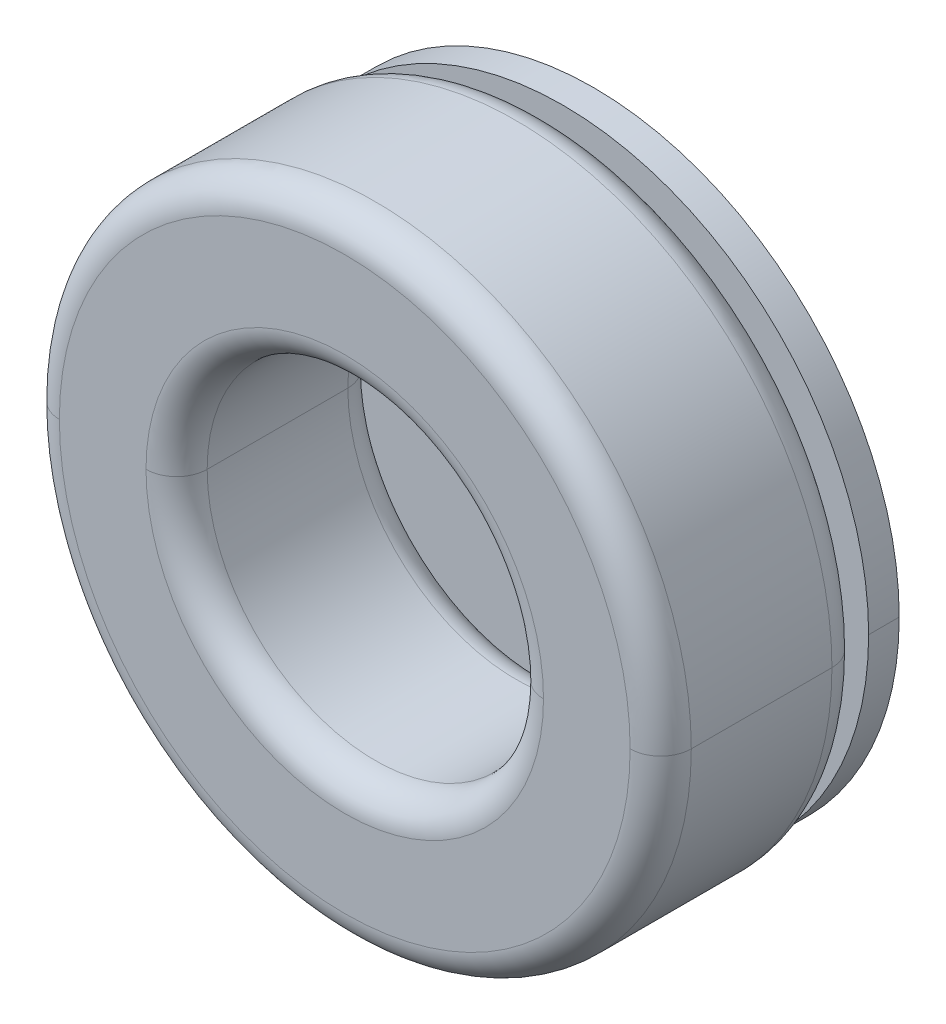
ISO-10303-21;
HEADER;
FILE_DESCRIPTION(('STEP AP214'),'2;1');
FILE_NAME('part.step','',(''),(''),'','','');
FILE_SCHEMA(('AUTOMOTIVE_DESIGN { 1 0 10303 214 1 1 1 1 }'));
ENDSEC;
DATA;
#1=APPLICATION_CONTEXT('core data for automotive mechanical design processes');
#2=APPLICATION_PROTOCOL_DEFINITION('international standard','automotive_design',2000,#1);
#3=PRODUCT_CONTEXT('',#1,'mechanical');
#4=PRODUCT('Part','Part','',(#3));
#5=PRODUCT_RELATED_PRODUCT_CATEGORY('part','',(#4));
#6=PRODUCT_DEFINITION_FORMATION('','',#4);
#7=PRODUCT_DEFINITION_CONTEXT('part definition',#1,'design');
#8=PRODUCT_DEFINITION('design','',#6,#7);
#9=PRODUCT_DEFINITION_SHAPE('','',#8);
#10=(LENGTH_UNIT() NAMED_UNIT(*) SI_UNIT(.MILLI.,.METRE.));
#11=(NAMED_UNIT(*) PLANE_ANGLE_UNIT() SI_UNIT($,.RADIAN.));
#12=(NAMED_UNIT(*) SI_UNIT($,.STERADIAN.) SOLID_ANGLE_UNIT());
#13=UNCERTAINTY_MEASURE_WITH_UNIT(LENGTH_MEASURE(1.E-05),#10,'distance_accuracy_value','');
#14=(GEOMETRIC_REPRESENTATION_CONTEXT(3) GLOBAL_UNCERTAINTY_ASSIGNED_CONTEXT((#13)) GLOBAL_UNIT_ASSIGNED_CONTEXT((#10,
#11,#12)) REPRESENTATION_CONTEXT('',''));
#15=CARTESIAN_POINT('',(0.,0.,0.));
#16=DIRECTION('',(0.,0.,1.));
#17=DIRECTION('',(1.,0.,0.));
#18=AXIS2_PLACEMENT_3D('',#15,#16,#17);
#19=CARTESIAN_POINT('',(0.,0.,2.3));
#20=DIRECTION('',(0.,0.,-1.));
#21=DIRECTION('',(0.,-1.,0.));
#22=AXIS2_PLACEMENT_3D('',#19,#20,#21);
#23=PLANE('',#22);
#24=CARTESIAN_POINT('',(0.,0.,2.3));
#25=DIRECTION('',(0.,0.,1.));
#26=DIRECTION('',(1.,0.,0.));
#27=AXIS2_PLACEMENT_3D('',#24,#25,#26);
#28=CIRCLE('',#27,9.75);
#29=CARTESIAN_POINT('',(9.75,0.,2.3));
#30=VERTEX_POINT('',#29);
#31=CARTESIAN_POINT('',(-9.75,0.,2.3));
#32=VERTEX_POINT('',#31);
#33=EDGE_CURVE('P0_E118',#30,#32,#28,.T.);
#34=ORIENTED_EDGE('',*,*,#33,.T.);
#35=CARTESIAN_POINT('',(0.,0.,2.3));
#36=DIRECTION('',(0.,0.,1.));
#37=DIRECTION('',(1.,0.,0.));
#38=AXIS2_PLACEMENT_3D('',#35,#36,#37);
#39=CIRCLE('',#38,9.75);
#40=EDGE_CURVE('P0_E90',#32,#30,#39,.T.);
#41=ORIENTED_EDGE('',*,*,#40,.T.);
#42=EDGE_LOOP('',(#34,#41));
#43=FACE_BOUND('',#42,.T.);
#44=CARTESIAN_POINT('',(0.,0.,2.3));
#45=DIRECTION('',(0.,0.,1.));
#46=DIRECTION('',(1.,0.,0.));
#47=AXIS2_PLACEMENT_3D('',#44,#45,#46);
#48=CIRCLE('',#47,14.);
#49=CARTESIAN_POINT('',(14.,0.,2.3));
#50=VERTEX_POINT('',#49);
#51=CARTESIAN_POINT('',(-14.,0.,2.3));
#52=VERTEX_POINT('',#51);
#53=EDGE_CURVE('P0_E173',#50,#52,#48,.T.);
#54=ORIENTED_EDGE('',*,*,#53,.F.);
#55=CARTESIAN_POINT('',(0.,0.,2.3));
#56=DIRECTION('',(0.,0.,1.));
#57=DIRECTION('',(1.,0.,0.));
#58=AXIS2_PLACEMENT_3D('',#55,#56,#57);
#59=CIRCLE('',#58,14.);
#60=EDGE_CURVE('P0_E28',#52,#50,#59,.T.);
#61=ORIENTED_EDGE('',*,*,#60,.F.);
#62=EDGE_LOOP('',(#54,#61));
#63=FACE_BOUND('',#62,.T.);
#64=ADVANCED_FACE('P0_F17',(#43,#63),#23,.T.);
#65=CARTESIAN_POINT('',(0.,0.,12.2));
#66=DIRECTION('',(0.,0.,1.));
#67=DIRECTION('',(1.,0.,0.));
#68=AXIS2_PLACEMENT_3D('',#65,#66,#67);
#69=CYLINDRICAL_SURFACE('',#68,8.25);
#70=DIRECTION('',(0.,0.,1.));
#71=VECTOR('',#70,1.);
#72=CARTESIAN_POINT('',(-8.25,0.,12.2));
#73=LINE('',#72,#71);
#74=CARTESIAN_POINT('',(-8.25,0.,3.8));
#75=VERTEX_POINT('',#74);
#76=CARTESIAN_POINT('',(-8.25,0.,10.7));
#77=VERTEX_POINT('',#76);
#78=EDGE_CURVE('P0_E132',#75,#77,#73,.T.);
#79=ORIENTED_EDGE('',*,*,#78,.F.);
#80=CARTESIAN_POINT('',(0.,0.,3.8));
#81=DIRECTION('',(0.,0.,1.));
#82=DIRECTION('',(1.,0.,0.));
#83=AXIS2_PLACEMENT_3D('',#80,#81,#82);
#84=CIRCLE('',#83,8.25);
#85=CARTESIAN_POINT('',(8.25,0.,3.8));
#86=VERTEX_POINT('',#85);
#87=EDGE_CURVE('P0_E119',#86,#75,#84,.T.);
#88=ORIENTED_EDGE('',*,*,#87,.F.);
#89=DIRECTION('',(0.,0.,1.));
#90=VECTOR('',#89,1.);
#91=CARTESIAN_POINT('',(8.25,0.,12.2));
#92=LINE('',#91,#90);
#93=CARTESIAN_POINT('',(8.25,0.,10.7));
#94=VERTEX_POINT('',#93);
#95=EDGE_CURVE('P0_E143',#86,#94,#92,.T.);
#96=ORIENTED_EDGE('',*,*,#95,.T.);
#97=CARTESIAN_POINT('',(0.,0.,10.7));
#98=DIRECTION('',(0.,0.,1.));
#99=DIRECTION('',(1.,0.,0.));
#100=AXIS2_PLACEMENT_3D('',#97,#98,#99);
#101=CIRCLE('',#100,8.25);
#102=EDGE_CURVE('P0_E135',#94,#77,#101,.T.);
#103=ORIENTED_EDGE('',*,*,#102,.T.);
#104=EDGE_LOOP('',(#79,#88,#96,#103));
#105=FACE_BOUND('',#104,.T.);
#106=ADVANCED_FACE('P0_F133',(#105),#69,.F.);
#107=CARTESIAN_POINT('',(0.,0.,12.2));
#108=DIRECTION('',(0.,0.,1.));
#109=DIRECTION('',(1.,0.,0.));
#110=AXIS2_PLACEMENT_3D('',#107,#108,#109);
#111=PLANE('',#110);
#112=CARTESIAN_POINT('',(0.,0.,12.2));
#113=DIRECTION('',(0.,0.,1.));
#114=DIRECTION('',(1.,0.,0.));
#115=AXIS2_PLACEMENT_3D('',#112,#113,#114);
#116=CIRCLE('',#115,9.75);
#117=CARTESIAN_POINT('',(9.75,0.,12.2));
#118=VERTEX_POINT('',#117);
#119=CARTESIAN_POINT('',(-9.75,0.,12.2));
#120=VERTEX_POINT('',#119);
#121=EDGE_CURVE('P0_E181',#118,#120,#116,.T.);
#122=ORIENTED_EDGE('',*,*,#121,.F.);
#123=CARTESIAN_POINT('',(0.,0.,12.2));
#124=DIRECTION('',(0.,0.,1.));
#125=DIRECTION('',(1.,0.,0.));
#126=AXIS2_PLACEMENT_3D('',#123,#124,#125);
#127=CIRCLE('',#126,9.75);
#128=EDGE_CURVE('P0_E21',#120,#118,#127,.T.);
#129=ORIENTED_EDGE('',*,*,#128,.F.);
#130=EDGE_LOOP('',(#122,#129));
#131=FACE_BOUND('',#130,.T.);
#132=CARTESIAN_POINT('',(0.,0.,12.2));
#133=DIRECTION('',(0.,0.,1.));
#134=DIRECTION('',(1.,0.,0.));
#135=AXIS2_PLACEMENT_3D('',#132,#133,#134);
#136=CIRCLE('',#135,14.);
#137=CARTESIAN_POINT('',(14.,0.,12.2));
#138=VERTEX_POINT('',#137);
#139=CARTESIAN_POINT('',(-14.,0.,12.2));
#140=VERTEX_POINT('',#139);
#141=EDGE_CURVE('P0_E159',#138,#140,#136,.T.);
#142=ORIENTED_EDGE('',*,*,#141,.T.);
#143=CARTESIAN_POINT('',(0.,0.,12.2));
#144=DIRECTION('',(0.,0.,1.));
#145=DIRECTION('',(1.,0.,0.));
#146=AXIS2_PLACEMENT_3D('',#143,#144,#145);
#147=CIRCLE('',#146,14.);
#148=EDGE_CURVE('P0_E80',#140,#138,#147,.T.);
#149=ORIENTED_EDGE('',*,*,#148,.T.);
#150=EDGE_LOOP('',(#142,#149));
#151=FACE_BOUND('',#150,.T.);
#152=ADVANCED_FACE('P0_F355',(#131,#151),#111,.T.);
#153=CARTESIAN_POINT('',(0.,0.,2.3));
#154=DIRECTION('',(0.,0.,1.));
#155=DIRECTION('',(1.,0.,0.));
#156=AXIS2_PLACEMENT_3D('',#153,#154,#155);
#157=CYLINDRICAL_SURFACE('',#156,15.5);
#158=DIRECTION('',(0.,0.,1.));
#159=VECTOR('',#158,1.);
#160=CARTESIAN_POINT('',(-15.5,0.,2.3));
#161=LINE('',#160,#159);
#162=CARTESIAN_POINT('',(-15.5,0.,3.8));
#163=VERTEX_POINT('',#162);
#164=CARTESIAN_POINT('',(-15.5,0.,10.7));
#165=VERTEX_POINT('',#164);
#166=EDGE_CURVE('P0_E166',#163,#165,#161,.T.);
#167=ORIENTED_EDGE('',*,*,#166,.F.);
#168=CARTESIAN_POINT('',(0.,0.,3.8));
#169=DIRECTION('',(0.,0.,1.));
#170=DIRECTION('',(1.,0.,0.));
#171=AXIS2_PLACEMENT_3D('',#168,#169,#170);
#172=CIRCLE('',#171,15.5);
#173=CARTESIAN_POINT('',(15.5,0.,3.8));
#174=VERTEX_POINT('',#173);
#175=EDGE_CURVE('P0_E11',#163,#174,#172,.T.);
#176=ORIENTED_EDGE('',*,*,#175,.T.);
#177=DIRECTION('',(0.,0.,1.));
#178=VECTOR('',#177,1.);
#179=CARTESIAN_POINT('',(15.5,0.,2.3));
#180=LINE('',#179,#178);
#181=CARTESIAN_POINT('',(15.5,0.,10.7));
#182=VERTEX_POINT('',#181);
#183=EDGE_CURVE('P0_E174',#174,#182,#180,.T.);
#184=ORIENTED_EDGE('',*,*,#183,.T.);
#185=CARTESIAN_POINT('',(0.,0.,10.7));
#186=DIRECTION('',(0.,0.,1.));
#187=DIRECTION('',(1.,0.,0.));
#188=AXIS2_PLACEMENT_3D('',#185,#186,#187);
#189=CIRCLE('',#188,15.5);
#190=EDGE_CURVE('P0_E152',#165,#182,#189,.T.);
#191=ORIENTED_EDGE('',*,*,#190,.F.);
#192=EDGE_LOOP('',(#167,#176,#184,#191));
#193=FACE_BOUND('',#192,.T.);
#194=ADVANCED_FACE('P0_F218',(#193),#157,.T.);
#195=CARTESIAN_POINT('',(0.,0.,3.8));
#196=DIRECTION('',(0.,0.,1.));
#197=DIRECTION('',(1.,0.,0.));
#198=AXIS2_PLACEMENT_3D('',#195,#196,#197);
#199=TOROIDAL_SURFACE('',#198,14.,1.5);
#200=CARTESIAN_POINT('',(-14.,0.,3.8));
#201=DIRECTION('',(0.,1.,0.));
#202=DIRECTION('',(-1.,0.,0.));
#203=AXIS2_PLACEMENT_3D('',#200,#201,#202);
#204=CIRCLE('',#203,1.5);
#205=EDGE_CURVE('P0_E168',#52,#163,#204,.T.);
#206=ORIENTED_EDGE('',*,*,#205,.F.);
#207=ORIENTED_EDGE('',*,*,#60,.T.);
#208=CARTESIAN_POINT('',(14.,0.,3.8));
#209=DIRECTION('',(0.,-1.,0.));
#210=DIRECTION('',(0.,0.,-1.));
#211=AXIS2_PLACEMENT_3D('',#208,#209,#210);
#212=CIRCLE('',#211,1.5);
#213=EDGE_CURVE('P0_E172',#50,#174,#212,.T.);
#214=ORIENTED_EDGE('',*,*,#213,.T.);
#215=ORIENTED_EDGE('',*,*,#175,.F.);
#216=EDGE_LOOP('',(#206,#207,#214,#215));
#217=FACE_BOUND('',#216,.T.);
#218=ADVANCED_FACE('P0_F207',(#217),#199,.T.);
#219=CARTESIAN_POINT('',(0.,0.,10.7));
#220=DIRECTION('',(0.,0.,1.));
#221=DIRECTION('',(1.,0.,0.));
#222=AXIS2_PLACEMENT_3D('',#219,#220,#221);
#223=TOROIDAL_SURFACE('',#222,14.,1.5);
#224=CARTESIAN_POINT('',(-14.,0.,10.7));
#225=DIRECTION('',(0.,1.,0.));
#226=DIRECTION('',(-1.,0.,0.));
#227=AXIS2_PLACEMENT_3D('',#224,#225,#226);
#228=CIRCLE('',#227,1.5);
#229=EDGE_CURVE('P0_E162',#165,#140,#228,.T.);
#230=ORIENTED_EDGE('',*,*,#229,.F.);
#231=ORIENTED_EDGE('',*,*,#190,.T.);
#232=CARTESIAN_POINT('',(14.,0.,10.7));
#233=DIRECTION('',(0.,-1.,0.));
#234=DIRECTION('',(0.,0.,-1.));
#235=AXIS2_PLACEMENT_3D('',#232,#233,#234);
#236=CIRCLE('',#235,1.5);
#237=EDGE_CURVE('P0_E129',#182,#138,#236,.T.);
#238=ORIENTED_EDGE('',*,*,#237,.T.);
#239=ORIENTED_EDGE('',*,*,#148,.F.);
#240=EDGE_LOOP('',(#230,#231,#238,#239));
#241=FACE_BOUND('',#240,.T.);
#242=ADVANCED_FACE('P0_F377',(#241),#223,.T.);
#243=CARTESIAN_POINT('',(0.,0.,3.8));
#244=DIRECTION('',(0.,0.,1.));
#245=DIRECTION('',(1.,0.,0.));
#246=AXIS2_PLACEMENT_3D('',#243,#244,#245);
#247=TOROIDAL_SURFACE('',#246,9.75,1.5);
#248=CARTESIAN_POINT('',(-9.75,0.,3.8));
#249=DIRECTION('',(0.,1.,0.));
#250=DIRECTION('',(-1.,0.,0.));
#251=AXIS2_PLACEMENT_3D('',#248,#249,#250);
#252=CIRCLE('',#251,1.5);
#253=EDGE_CURVE('P0_E110',#75,#32,#252,.T.);
#254=ORIENTED_EDGE('',*,*,#253,.F.);
#255=CARTESIAN_POINT('',(0.,0.,3.8));
#256=DIRECTION('',(0.,0.,1.));
#257=DIRECTION('',(1.,0.,0.));
#258=AXIS2_PLACEMENT_3D('',#255,#256,#257);
#259=CIRCLE('',#258,8.25);
#260=EDGE_CURVE('P0_E114',#75,#86,#259,.T.);
#261=ORIENTED_EDGE('',*,*,#260,.T.);
#262=CARTESIAN_POINT('',(9.75,0.,3.8));
#263=DIRECTION('',(0.,-1.,0.));
#264=DIRECTION('',(0.,0.,-1.));
#265=AXIS2_PLACEMENT_3D('',#262,#263,#264);
#266=CIRCLE('',#265,1.5);
#267=EDGE_CURVE('P0_E124',#86,#30,#266,.T.);
#268=ORIENTED_EDGE('',*,*,#267,.T.);
#269=ORIENTED_EDGE('',*,*,#40,.F.);
#270=EDGE_LOOP('',(#254,#261,#268,#269));
#271=FACE_BOUND('',#270,.T.);
#272=ADVANCED_FACE('P0_F112',(#271),#247,.T.);
#273=CARTESIAN_POINT('',(0.,0.,10.7));
#274=DIRECTION('',(0.,0.,1.));
#275=DIRECTION('',(1.,0.,0.));
#276=AXIS2_PLACEMENT_3D('',#273,#274,#275);
#277=TOROIDAL_SURFACE('',#276,9.75,1.5);
#278=CARTESIAN_POINT('',(-9.75,0.,10.7));
#279=DIRECTION('',(0.,1.,0.));
#280=DIRECTION('',(-1.,0.,0.));
#281=AXIS2_PLACEMENT_3D('',#278,#279,#280);
#282=CIRCLE('',#281,1.5);
#283=EDGE_CURVE('P0_E179',#120,#77,#282,.T.);
#284=ORIENTED_EDGE('',*,*,#283,.F.);
#285=ORIENTED_EDGE('',*,*,#128,.T.);
#286=CARTESIAN_POINT('',(9.75,0.,10.7));
#287=DIRECTION('',(0.,-1.,0.));
#288=DIRECTION('',(0.,0.,-1.));
#289=AXIS2_PLACEMENT_3D('',#286,#287,#288);
#290=CIRCLE('',#289,1.5);
#291=EDGE_CURVE('P0_E473',#118,#94,#290,.T.);
#292=ORIENTED_EDGE('',*,*,#291,.T.);
#293=CARTESIAN_POINT('',(0.,0.,10.7));
#294=DIRECTION('',(0.,0.,1.));
#295=DIRECTION('',(1.,0.,0.));
#296=AXIS2_PLACEMENT_3D('',#293,#294,#295);
#297=CIRCLE('',#296,8.25);
#298=EDGE_CURVE('P0_E140',#77,#94,#297,.T.);
#299=ORIENTED_EDGE('',*,*,#298,.F.);
#300=EDGE_LOOP('',(#284,#285,#292,#299));
#301=FACE_BOUND('',#300,.T.);
#302=ADVANCED_FACE('P0_F385',(#301),#277,.T.);
#303=CARTESIAN_POINT('',(0.,0.,10.7));
#304=DIRECTION('',(0.,0.,1.));
#305=DIRECTION('',(1.,0.,0.));
#306=AXIS2_PLACEMENT_3D('',#303,#304,#305);
#307=TOROIDAL_SURFACE('',#306,9.75,1.5);
#308=ORIENTED_EDGE('',*,*,#121,.T.);
#309=ORIENTED_EDGE('',*,*,#283,.T.);
#310=ORIENTED_EDGE('',*,*,#102,.F.);
#311=ORIENTED_EDGE('',*,*,#291,.F.);
#312=EDGE_LOOP('',(#308,#309,#310,#311));
#313=FACE_BOUND('',#312,.T.);
#314=ADVANCED_FACE('P0_F389',(#313),#307,.T.);
#315=CARTESIAN_POINT('',(0.,0.,3.8));
#316=DIRECTION('',(0.,0.,1.));
#317=DIRECTION('',(1.,0.,0.));
#318=AXIS2_PLACEMENT_3D('',#315,#316,#317);
#319=TOROIDAL_SURFACE('',#318,9.75,1.5);
#320=ORIENTED_EDGE('',*,*,#87,.T.);
#321=ORIENTED_EDGE('',*,*,#253,.T.);
#322=ORIENTED_EDGE('',*,*,#33,.F.);
#323=ORIENTED_EDGE('',*,*,#267,.F.);
#324=EDGE_LOOP('',(#320,#321,#322,#323));
#325=FACE_BOUND('',#324,.T.);
#326=ADVANCED_FACE('P0_F123',(#325),#319,.T.);
#327=CARTESIAN_POINT('',(0.,0.,10.7));
#328=DIRECTION('',(0.,0.,1.));
#329=DIRECTION('',(1.,0.,0.));
#330=AXIS2_PLACEMENT_3D('',#327,#328,#329);
#331=TOROIDAL_SURFACE('',#330,14.,1.5);
#332=CARTESIAN_POINT('',(0.,0.,10.7));
#333=DIRECTION('',(0.,0.,1.));
#334=DIRECTION('',(1.,0.,0.));
#335=AXIS2_PLACEMENT_3D('',#332,#333,#334);
#336=CIRCLE('',#335,15.5);
#337=EDGE_CURVE('P0_E178',#182,#165,#336,.T.);
#338=ORIENTED_EDGE('',*,*,#337,.T.);
#339=ORIENTED_EDGE('',*,*,#229,.T.);
#340=ORIENTED_EDGE('',*,*,#141,.F.);
#341=ORIENTED_EDGE('',*,*,#237,.F.);
#342=EDGE_LOOP('',(#338,#339,#340,#341));
#343=FACE_BOUND('',#342,.T.);
#344=ADVANCED_FACE('P0_F366',(#343),#331,.T.);
#345=CARTESIAN_POINT('',(0.,0.,3.8));
#346=DIRECTION('',(0.,0.,1.));
#347=DIRECTION('',(1.,0.,0.));
#348=AXIS2_PLACEMENT_3D('',#345,#346,#347);
#349=TOROIDAL_SURFACE('',#348,14.,1.5);
#350=ORIENTED_EDGE('',*,*,#53,.T.);
#351=ORIENTED_EDGE('',*,*,#205,.T.);
#352=CARTESIAN_POINT('',(0.,0.,3.8));
#353=DIRECTION('',(0.,0.,1.));
#354=DIRECTION('',(1.,0.,0.));
#355=AXIS2_PLACEMENT_3D('',#352,#353,#354);
#356=CIRCLE('',#355,15.5);
#357=EDGE_CURVE('P0_E163',#174,#163,#356,.T.);
#358=ORIENTED_EDGE('',*,*,#357,.F.);
#359=ORIENTED_EDGE('',*,*,#213,.F.);
#360=EDGE_LOOP('',(#350,#351,#358,#359));
#361=FACE_BOUND('',#360,.T.);
#362=ADVANCED_FACE('P0_F216',(#361),#349,.T.);
#363=CARTESIAN_POINT('',(0.,0.,2.3));
#364=DIRECTION('',(0.,0.,1.));
#365=DIRECTION('',(1.,0.,0.));
#366=AXIS2_PLACEMENT_3D('',#363,#364,#365);
#367=CYLINDRICAL_SURFACE('',#366,15.5);
#368=ORIENTED_EDGE('',*,*,#357,.T.);
#369=ORIENTED_EDGE('',*,*,#166,.T.);
#370=ORIENTED_EDGE('',*,*,#337,.F.);
#371=ORIENTED_EDGE('',*,*,#183,.F.);
#372=EDGE_LOOP('',(#368,#369,#370,#371));
#373=FACE_BOUND('',#372,.T.);
#374=ADVANCED_FACE('P0_F19',(#373),#367,.T.);
#375=CARTESIAN_POINT('',(0.,0.,12.2));
#376=DIRECTION('',(0.,0.,1.));
#377=DIRECTION('',(1.,0.,0.));
#378=AXIS2_PLACEMENT_3D('',#375,#376,#377);
#379=CYLINDRICAL_SURFACE('',#378,8.25);
#380=ORIENTED_EDGE('',*,*,#260,.F.);
#381=ORIENTED_EDGE('',*,*,#78,.T.);
#382=ORIENTED_EDGE('',*,*,#298,.T.);
#383=ORIENTED_EDGE('',*,*,#95,.F.);
#384=EDGE_LOOP('',(#380,#381,#382,#383));
#385=FACE_BOUND('',#384,.T.);
#386=ADVANCED_FACE('P0_F142',(#385),#379,.F.);
#387=CLOSED_SHELL('',(#64,#106,#152,#194,#218,#242,#272,#302,#314,#326,#344,#362,#374,#386));
#388=MANIFOLD_SOLID_BREP('P0_B1',#387);
#389=CARTESIAN_POINT('',(0.,0.,1.5));
#390=DIRECTION('',(0.,0.,1.));
#391=DIRECTION('',(1.,0.,0.));
#392=AXIS2_PLACEMENT_3D('',#389,#390,#391);
#393=CYLINDRICAL_SURFACE('',#392,5.4);
#394=DIRECTION('',(0.,0.,1.));
#395=VECTOR('',#394,1.);
#396=CARTESIAN_POINT('',(-5.4,0.,1.5));
#397=LINE('',#396,#395);
#398=CARTESIAN_POINT('',(-5.4,0.,0.));
#399=VERTEX_POINT('',#398);
#400=CARTESIAN_POINT('',(-5.4,0.,1.5));
#401=VERTEX_POINT('',#400);
#402=EDGE_CURVE('P1_E73',#399,#401,#397,.T.);
#403=ORIENTED_EDGE('',*,*,#402,.F.);
#404=CARTESIAN_POINT('',(0.,0.,0.));
#405=DIRECTION('',(0.,0.,1.));
#406=DIRECTION('',(1.,0.,0.));
#407=AXIS2_PLACEMENT_3D('',#404,#405,#406);
#408=CIRCLE('',#407,5.4);
#409=CARTESIAN_POINT('',(5.4,0.,0.));
#410=VERTEX_POINT('',#409);
#411=EDGE_CURVE('P1_E28',#410,#399,#408,.T.);
#412=ORIENTED_EDGE('',*,*,#411,.F.);
#413=DIRECTION('',(0.,0.,1.));
#414=VECTOR('',#413,1.);
#415=CARTESIAN_POINT('',(5.4,0.,1.5));
#416=LINE('',#415,#414);
#417=CARTESIAN_POINT('',(5.4,0.,1.5));
#418=VERTEX_POINT('',#417);
#419=EDGE_CURVE('P1_E21',#410,#418,#416,.T.);
#420=ORIENTED_EDGE('',*,*,#419,.T.);
#421=CARTESIAN_POINT('',(0.,0.,1.5));
#422=DIRECTION('',(0.,0.,1.));
#423=DIRECTION('',(1.,0.,0.));
#424=AXIS2_PLACEMENT_3D('',#421,#422,#423);
#425=CIRCLE('',#424,5.4);
#426=EDGE_CURVE('P1_E11',#418,#401,#425,.T.);
#427=ORIENTED_EDGE('',*,*,#426,.T.);
#428=EDGE_LOOP('',(#403,#412,#420,#427));
#429=FACE_BOUND('',#428,.T.);
#430=ADVANCED_FACE('P1_F17',(#429),#393,.F.);
#431=CARTESIAN_POINT('',(0.,0.,1.5));
#432=DIRECTION('',(0.,0.,1.));
#433=DIRECTION('',(1.,0.,0.));
#434=AXIS2_PLACEMENT_3D('',#431,#432,#433);
#435=PLANE('',#434);
#436=ORIENTED_EDGE('',*,*,#426,.F.);
#437=CARTESIAN_POINT('',(0.,0.,1.5));
#438=DIRECTION('',(0.,0.,1.));
#439=DIRECTION('',(1.,0.,0.));
#440=AXIS2_PLACEMENT_3D('',#437,#438,#439);
#441=CIRCLE('',#440,5.4);
#442=EDGE_CURVE('P1_E77',#401,#418,#441,.T.);
#443=ORIENTED_EDGE('',*,*,#442,.F.);
#444=EDGE_LOOP('',(#436,#443));
#445=FACE_BOUND('',#444,.T.);
#446=CARTESIAN_POINT('',(0.,0.,1.5));
#447=DIRECTION('',(0.,0.,1.));
#448=DIRECTION('',(1.,0.,0.));
#449=AXIS2_PLACEMENT_3D('',#446,#447,#448);
#450=CIRCLE('',#449,15.);
#451=CARTESIAN_POINT('',(15.,0.,1.5));
#452=VERTEX_POINT('',#451);
#453=CARTESIAN_POINT('',(-15.,0.,1.5));
#454=VERTEX_POINT('',#453);
#455=EDGE_CURVE('P1_E96',#452,#454,#450,.T.);
#456=ORIENTED_EDGE('',*,*,#455,.T.);
#457=CARTESIAN_POINT('',(0.,0.,1.5));
#458=DIRECTION('',(0.,0.,1.));
#459=DIRECTION('',(1.,0.,0.));
#460=AXIS2_PLACEMENT_3D('',#457,#458,#459);
#461=CIRCLE('',#460,15.);
#462=EDGE_CURVE('P1_E42',#454,#452,#461,.T.);
#463=ORIENTED_EDGE('',*,*,#462,.T.);
#464=EDGE_LOOP('',(#456,#463));
#465=FACE_BOUND('',#464,.T.);
#466=ADVANCED_FACE('P1_F19',(#445,#465),#435,.T.);
#467=CARTESIAN_POINT('',(0.,0.,0.));
#468=DIRECTION('',(0.,0.,-1.));
#469=DIRECTION('',(0.,-1.,0.));
#470=AXIS2_PLACEMENT_3D('',#467,#468,#469);
#471=PLANE('',#470);
#472=ORIENTED_EDGE('',*,*,#411,.T.);
#473=CARTESIAN_POINT('',(0.,0.,0.));
#474=DIRECTION('',(0.,0.,1.));
#475=DIRECTION('',(1.,0.,0.));
#476=AXIS2_PLACEMENT_3D('',#473,#474,#475);
#477=CIRCLE('',#476,5.4);
#478=EDGE_CURVE('P1_E82',#399,#410,#477,.T.);
#479=ORIENTED_EDGE('',*,*,#478,.T.);
#480=EDGE_LOOP('',(#472,#479));
#481=FACE_BOUND('',#480,.T.);
#482=CARTESIAN_POINT('',(0.,0.,0.));
#483=DIRECTION('',(0.,0.,1.));
#484=DIRECTION('',(1.,0.,0.));
#485=AXIS2_PLACEMENT_3D('',#482,#483,#484);
#486=CIRCLE('',#485,15.);
#487=CARTESIAN_POINT('',(15.,0.,0.));
#488=VERTEX_POINT('',#487);
#489=CARTESIAN_POINT('',(-15.,0.,0.));
#490=VERTEX_POINT('',#489);
#491=EDGE_CURVE('P1_E97',#488,#490,#486,.T.);
#492=ORIENTED_EDGE('',*,*,#491,.F.);
#493=CARTESIAN_POINT('',(0.,0.,0.));
#494=DIRECTION('',(0.,0.,1.));
#495=DIRECTION('',(1.,0.,0.));
#496=AXIS2_PLACEMENT_3D('',#493,#494,#495);
#497=CIRCLE('',#496,15.);
#498=EDGE_CURVE('P1_E101',#490,#488,#497,.T.);
#499=ORIENTED_EDGE('',*,*,#498,.F.);
#500=EDGE_LOOP('',(#492,#499));
#501=FACE_BOUND('',#500,.T.);
#502=ADVANCED_FACE('P1_F160',(#481,#501),#471,.T.);
#503=CARTESIAN_POINT('',(0.,0.,0.));
#504=DIRECTION('',(0.,0.,1.));
#505=DIRECTION('',(1.,0.,0.));
#506=AXIS2_PLACEMENT_3D('',#503,#504,#505);
#507=CYLINDRICAL_SURFACE('',#506,15.);
#508=DIRECTION('',(0.,0.,1.));
#509=VECTOR('',#508,1.);
#510=CARTESIAN_POINT('',(-15.,0.,0.));
#511=LINE('',#510,#509);
#512=EDGE_CURVE('P1_E92',#490,#454,#511,.T.);
#513=ORIENTED_EDGE('',*,*,#512,.F.);
#514=ORIENTED_EDGE('',*,*,#498,.T.);
#515=DIRECTION('',(0.,0.,1.));
#516=VECTOR('',#515,1.);
#517=CARTESIAN_POINT('',(15.,0.,0.));
#518=LINE('',#517,#516);
#519=EDGE_CURVE('P1_E98',#488,#452,#518,.T.);
#520=ORIENTED_EDGE('',*,*,#519,.T.);
#521=ORIENTED_EDGE('',*,*,#462,.F.);
#522=EDGE_LOOP('',(#513,#514,#520,#521));
#523=FACE_BOUND('',#522,.T.);
#524=ADVANCED_FACE('P1_F165',(#523),#507,.T.);
#525=CARTESIAN_POINT('',(0.,0.,0.));
#526=DIRECTION('',(0.,0.,1.));
#527=DIRECTION('',(1.,0.,0.));
#528=AXIS2_PLACEMENT_3D('',#525,#526,#527);
#529=CYLINDRICAL_SURFACE('',#528,15.);
#530=ORIENTED_EDGE('',*,*,#491,.T.);
#531=ORIENTED_EDGE('',*,*,#512,.T.);
#532=ORIENTED_EDGE('',*,*,#455,.F.);
#533=ORIENTED_EDGE('',*,*,#519,.F.);
#534=EDGE_LOOP('',(#530,#531,#532,#533));
#535=FACE_BOUND('',#534,.T.);
#536=ADVANCED_FACE('P1_F175',(#535),#529,.T.);
#537=CARTESIAN_POINT('',(0.,0.,1.5));
#538=DIRECTION('',(0.,0.,1.));
#539=DIRECTION('',(1.,0.,0.));
#540=AXIS2_PLACEMENT_3D('',#537,#538,#539);
#541=CYLINDRICAL_SURFACE('',#540,5.4);
#542=ORIENTED_EDGE('',*,*,#478,.F.);
#543=ORIENTED_EDGE('',*,*,#402,.T.);
#544=ORIENTED_EDGE('',*,*,#442,.T.);
#545=ORIENTED_EDGE('',*,*,#419,.F.);
#546=EDGE_LOOP('',(#542,#543,#544,#545));
#547=FACE_BOUND('',#546,.T.);
#548=ADVANCED_FACE('P1_F80',(#547),#541,.F.);
#549=CLOSED_SHELL('',(#430,#466,#502,#524,#536,#548));
#550=MANIFOLD_SOLID_BREP('P1_B1',#549);
#551=ADVANCED_BREP_SHAPE_REPRESENTATION('',(#18,#388,#550),#14);
#552=SHAPE_DEFINITION_REPRESENTATION(#9,#551);
ENDSEC;
END-ISO-10303-21;
